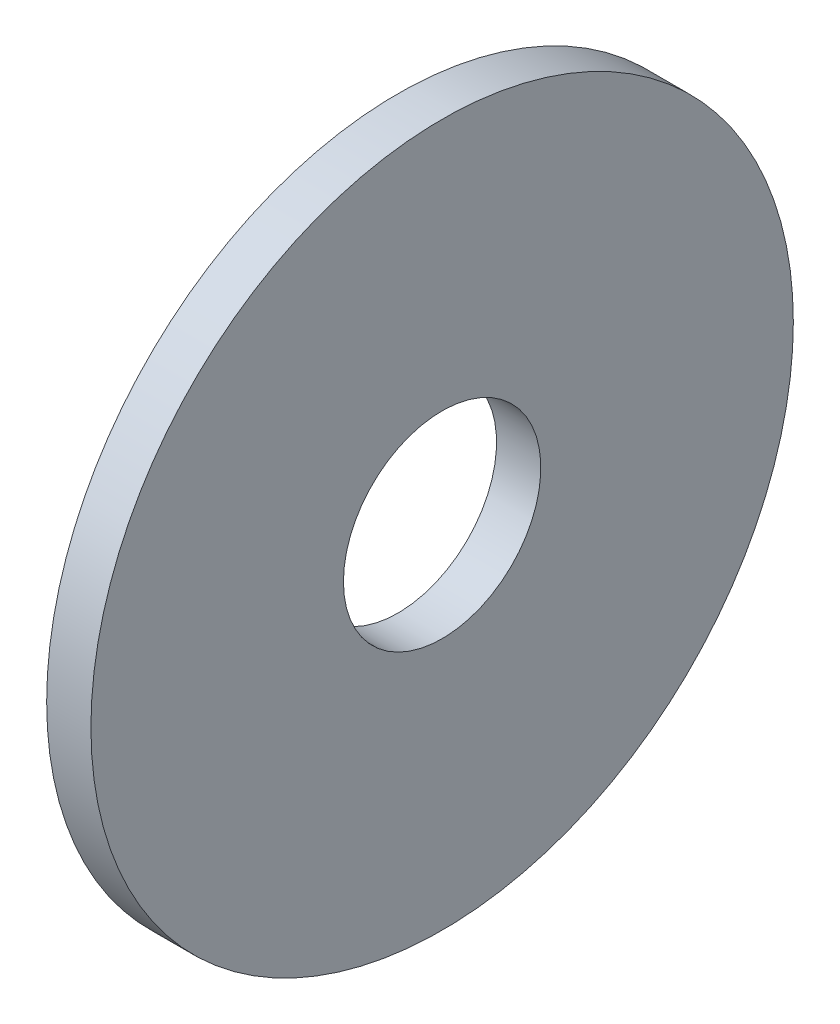
ISO-10303-21;
HEADER;
FILE_DESCRIPTION(('STEP AP214'),'2;1');
FILE_NAME('part.step','',(''),(''),'','','');
FILE_SCHEMA(('AUTOMOTIVE_DESIGN { 1 0 10303 214 1 1 1 1 }'));
ENDSEC;
DATA;
#1=APPLICATION_CONTEXT('core data for automotive mechanical design processes');
#2=APPLICATION_PROTOCOL_DEFINITION('international standard','automotive_design',2000,#1);
#3=PRODUCT_CONTEXT('',#1,'mechanical');
#4=PRODUCT('Part','Part','',(#3));
#5=PRODUCT_RELATED_PRODUCT_CATEGORY('part','',(#4));
#6=PRODUCT_DEFINITION_FORMATION('','',#4);
#7=PRODUCT_DEFINITION_CONTEXT('part definition',#1,'design');
#8=PRODUCT_DEFINITION('design','',#6,#7);
#9=PRODUCT_DEFINITION_SHAPE('','',#8);
#10=(LENGTH_UNIT() NAMED_UNIT(*) SI_UNIT(.MILLI.,.METRE.));
#11=(NAMED_UNIT(*) PLANE_ANGLE_UNIT() SI_UNIT($,.RADIAN.));
#12=(NAMED_UNIT(*) SI_UNIT($,.STERADIAN.) SOLID_ANGLE_UNIT());
#13=UNCERTAINTY_MEASURE_WITH_UNIT(LENGTH_MEASURE(1.E-05),#10,'distance_accuracy_value','');
#14=(GEOMETRIC_REPRESENTATION_CONTEXT(3) GLOBAL_UNCERTAINTY_ASSIGNED_CONTEXT((#13)) GLOBAL_UNIT_ASSIGNED_CONTEXT((#10,
#11,#12)) REPRESENTATION_CONTEXT('',''));
#15=CARTESIAN_POINT('',(0.,0.,0.));
#16=DIRECTION('',(0.,0.,1.));
#17=DIRECTION('',(1.,0.,0.));
#18=AXIS2_PLACEMENT_3D('',#15,#16,#17);
#19=CARTESIAN_POINT('',(-34.9249999999999,0.,0.));
#20=DIRECTION('',(-1.,0.,0.));
#21=DIRECTION('',(0.,0.,1.));
#22=AXIS2_PLACEMENT_3D('',#19,#20,#21);
#23=CYLINDRICAL_SURFACE('',#22,3.5687);
#24=CARTESIAN_POINT('',(0.,0.,0.));
#25=DIRECTION('',(-1.,0.,0.));
#26=DIRECTION('',(0.,0.,1.));
#27=AXIS2_PLACEMENT_3D('',#24,#25,#26);
#28=CIRCLE('',#27,3.5687);
#29=CARTESIAN_POINT('',(0.,0.,3.5687));
#30=VERTEX_POINT('',#29);
#31=EDGE_CURVE('E10',#30,#30,#28,.T.);
#32=ORIENTED_EDGE('',*,*,#31,.F.);
#33=EDGE_LOOP('',(#32));
#34=FACE_BOUND('',#33,.T.);
#35=CARTESIAN_POINT('',(-1.6002,0.,0.));
#36=DIRECTION('',(-1.,0.,0.));
#37=DIRECTION('',(0.,0.,1.));
#38=AXIS2_PLACEMENT_3D('',#35,#36,#37);
#39=CIRCLE('',#38,3.5687);
#40=CARTESIAN_POINT('',(-1.6002,0.,3.5687));
#41=VERTEX_POINT('',#40);
#42=EDGE_CURVE('E55',#41,#41,#39,.T.);
#43=ORIENTED_EDGE('',*,*,#42,.T.);
#44=EDGE_LOOP('',(#43));
#45=FACE_BOUND('',#44,.T.);
#46=ADVANCED_FACE('F37',(#34,#45),#23,.F.);
#47=CARTESIAN_POINT('',(0.,3.5687,0.));
#48=DIRECTION('',(-1.,0.,0.));
#49=DIRECTION('',(0.,0.,1.));
#50=AXIS2_PLACEMENT_3D('',#47,#48,#49);
#51=PLANE('',#50);
#52=CARTESIAN_POINT('',(0.,0.,0.));
#53=DIRECTION('',(-1.,0.,0.));
#54=DIRECTION('',(0.,0.,1.));
#55=AXIS2_PLACEMENT_3D('',#52,#53,#54);
#56=CIRCLE('',#55,12.7);
#57=CARTESIAN_POINT('',(0.,0.,12.7));
#58=VERTEX_POINT('',#57);
#59=EDGE_CURVE('E44',#58,#58,#56,.T.);
#60=ORIENTED_EDGE('',*,*,#59,.F.);
#61=EDGE_LOOP('',(#60));
#62=FACE_BOUND('',#61,.T.);
#63=ORIENTED_EDGE('',*,*,#31,.T.);
#64=EDGE_LOOP('',(#63));
#65=FACE_BOUND('',#64,.T.);
#66=ADVANCED_FACE('F70',(#62,#65),#51,.F.);
#67=CARTESIAN_POINT('',(-34.9249999999999,0.,0.));
#68=DIRECTION('',(-1.,0.,0.));
#69=DIRECTION('',(0.,0.,1.));
#70=AXIS2_PLACEMENT_3D('',#67,#68,#69);
#71=CYLINDRICAL_SURFACE('',#70,12.7);
#72=CARTESIAN_POINT('',(-1.6002,0.,0.));
#73=DIRECTION('',(-1.,0.,0.));
#74=DIRECTION('',(0.,0.,1.));
#75=AXIS2_PLACEMENT_3D('',#72,#73,#74);
#76=CIRCLE('',#75,12.7);
#77=CARTESIAN_POINT('',(-1.6002,0.,12.7));
#78=VERTEX_POINT('',#77);
#79=EDGE_CURVE('E51',#78,#78,#76,.T.);
#80=ORIENTED_EDGE('',*,*,#79,.F.);
#81=EDGE_LOOP('',(#80));
#82=FACE_BOUND('',#81,.T.);
#83=ORIENTED_EDGE('',*,*,#59,.T.);
#84=EDGE_LOOP('',(#83));
#85=FACE_BOUND('',#84,.T.);
#86=ADVANCED_FACE('F65',(#82,#85),#71,.T.);
#87=CARTESIAN_POINT('',(-1.6002,12.7,0.));
#88=DIRECTION('',(1.,0.,0.));
#89=DIRECTION('',(0.,0.,-1.));
#90=AXIS2_PLACEMENT_3D('',#87,#88,#89);
#91=PLANE('',#90);
#92=ORIENTED_EDGE('',*,*,#42,.F.);
#93=EDGE_LOOP('',(#92));
#94=FACE_BOUND('',#93,.T.);
#95=ORIENTED_EDGE('',*,*,#79,.T.);
#96=EDGE_LOOP('',(#95));
#97=FACE_BOUND('',#96,.T.);
#98=ADVANCED_FACE('F62',(#94,#97),#91,.F.);
#99=CLOSED_SHELL('',(#46,#66,#86,#98));
#100=MANIFOLD_SOLID_BREP('B2',#99);
#101=ADVANCED_BREP_SHAPE_REPRESENTATION('',(#18,#100),#14);
#102=SHAPE_DEFINITION_REPRESENTATION(#9,#101);
ENDSEC;
END-ISO-10303-21;
